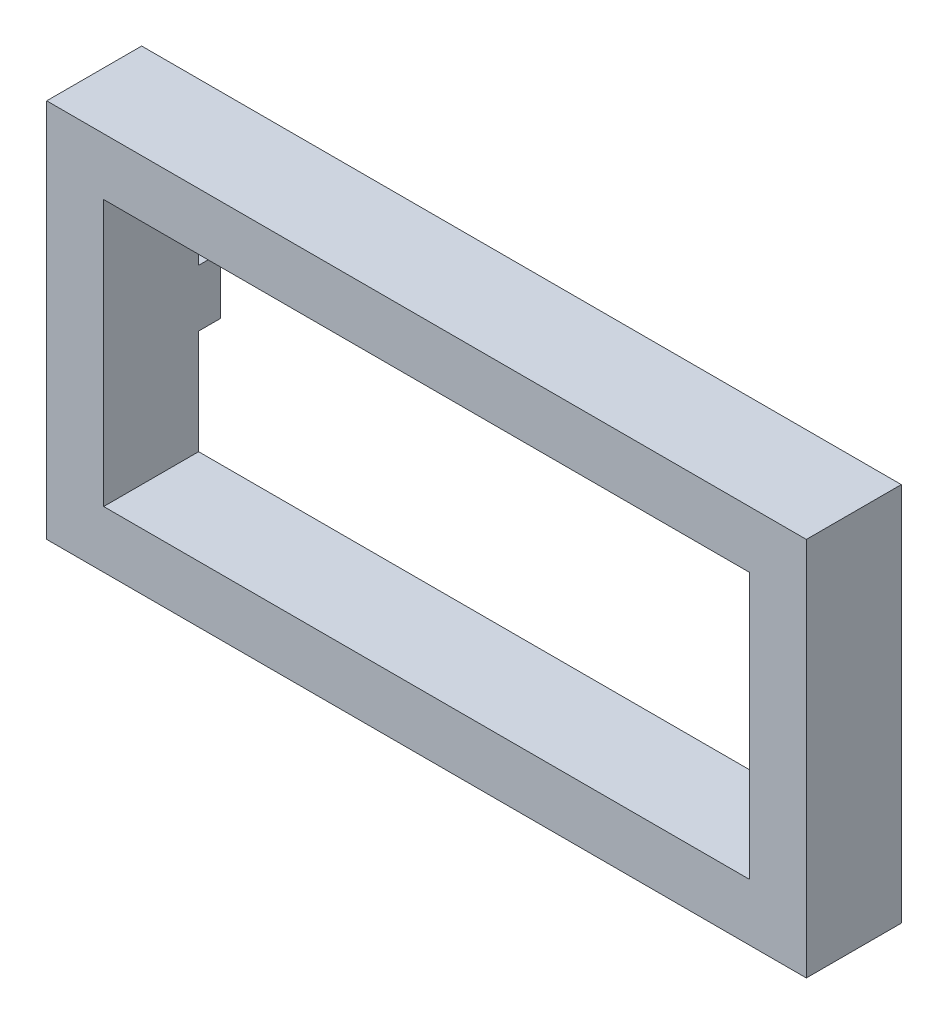
ISO-10303-21;
HEADER;
FILE_DESCRIPTION(('STEP AP214'),'2;1');
FILE_NAME('part.step','',(''),(''),'','','');
FILE_SCHEMA(('AUTOMOTIVE_DESIGN { 1 0 10303 214 1 1 1 1 }'));
ENDSEC;
DATA;
#1=APPLICATION_CONTEXT('core data for automotive mechanical design processes');
#2=APPLICATION_PROTOCOL_DEFINITION('international standard','automotive_design',2000,#1);
#3=PRODUCT_CONTEXT('',#1,'mechanical');
#4=PRODUCT('Part','Part','',(#3));
#5=PRODUCT_RELATED_PRODUCT_CATEGORY('part','',(#4));
#6=PRODUCT_DEFINITION_FORMATION('','',#4);
#7=PRODUCT_DEFINITION_CONTEXT('part definition',#1,'design');
#8=PRODUCT_DEFINITION('design','',#6,#7);
#9=PRODUCT_DEFINITION_SHAPE('','',#8);
#10=(LENGTH_UNIT() NAMED_UNIT(*) SI_UNIT(.MILLI.,.METRE.));
#11=(NAMED_UNIT(*) PLANE_ANGLE_UNIT() SI_UNIT($,.RADIAN.));
#12=(NAMED_UNIT(*) SI_UNIT($,.STERADIAN.) SOLID_ANGLE_UNIT());
#13=UNCERTAINTY_MEASURE_WITH_UNIT(LENGTH_MEASURE(1.E-05),#10,'distance_accuracy_value','');
#14=(GEOMETRIC_REPRESENTATION_CONTEXT(3) GLOBAL_UNCERTAINTY_ASSIGNED_CONTEXT((#13)) GLOBAL_UNIT_ASSIGNED_CONTEXT((#10,
#11,#12)) REPRESENTATION_CONTEXT('',''));
#15=CARTESIAN_POINT('',(0.,0.,0.));
#16=DIRECTION('',(0.,0.,1.));
#17=DIRECTION('',(1.,0.,0.));
#18=AXIS2_PLACEMENT_3D('',#15,#16,#17);
#19=CARTESIAN_POINT('',(0.,0.,0.));
#20=DIRECTION('',(0.,0.,1.));
#21=DIRECTION('',(1.,0.,0.));
#22=AXIS2_PLACEMENT_3D('',#19,#20,#21);
#23=PLANE('',#22);
#24=DIRECTION('',(1.,0.,0.));
#25=VECTOR('',#24,1.);
#26=CARTESIAN_POINT('',(70.4166666666664,92.4999999999996,0.));
#27=LINE('',#26,#25);
#28=CARTESIAN_POINT('',(70.4166666666664,92.4999999999996,0.));
#29=VERTEX_POINT('',#28);
#30=CARTESIAN_POINT('',(85.4166666666664,92.4999999999996,0.));
#31=VERTEX_POINT('',#30);
#32=EDGE_CURVE('E305',#29,#31,#27,.T.);
#33=ORIENTED_EDGE('',*,*,#32,.F.);
#34=DIRECTION('',(0.,1.,0.));
#35=VECTOR('',#34,1.);
#36=CARTESIAN_POINT('',(70.4166666666664,92.4999999999996,0.));
#37=LINE('',#36,#35);
#38=CARTESIAN_POINT('',(70.4166666666664,77.4999999999996,0.));
#39=VERTEX_POINT('',#38);
#40=EDGE_CURVE('E303',#39,#29,#37,.T.);
#41=ORIENTED_EDGE('',*,*,#40,.F.);
#42=DIRECTION('',(-1.,0.,0.));
#43=VECTOR('',#42,1.);
#44=CARTESIAN_POINT('',(70.4166666666664,77.4999999999996,0.));
#45=LINE('',#44,#43);
#46=CARTESIAN_POINT('',(85.4166666666664,77.4999999999996,0.));
#47=VERTEX_POINT('',#46);
#48=EDGE_CURVE('E293',#47,#39,#45,.T.);
#49=ORIENTED_EDGE('',*,*,#48,.F.);
#50=DIRECTION('',(0.,-1.,0.));
#51=VECTOR('',#50,1.);
#52=CARTESIAN_POINT('',(85.4166666666664,92.4999999999996,0.));
#53=LINE('',#52,#51);
#54=EDGE_CURVE('E309',#31,#47,#53,.T.);
#55=ORIENTED_EDGE('',*,*,#54,.F.);
#56=EDGE_LOOP('',(#33,#41,#49,#55));
#57=FACE_BOUND('',#56,.T.);
#58=DIRECTION('',(1.,0.,0.));
#59=VECTOR('',#58,1.);
#60=CARTESIAN_POINT('',(70.4166666666664,-77.5000000000004,0.));
#61=LINE('',#60,#59);
#62=CARTESIAN_POINT('',(70.4166666666664,-77.5000000000004,0.));
#63=VERTEX_POINT('',#62);
#64=CARTESIAN_POINT('',(85.4166666666664,-77.5000000000004,0.));
#65=VERTEX_POINT('',#64);
#66=EDGE_CURVE('E339',#63,#65,#61,.T.);
#67=ORIENTED_EDGE('',*,*,#66,.F.);
#68=DIRECTION('',(0.,1.,0.));
#69=VECTOR('',#68,1.);
#70=CARTESIAN_POINT('',(70.4166666666664,-77.5000000000004,0.));
#71=LINE('',#70,#69);
#72=CARTESIAN_POINT('',(70.4166666666664,-92.5000000000004,0.));
#73=VERTEX_POINT('',#72);
#74=EDGE_CURVE('E337',#73,#63,#71,.T.);
#75=ORIENTED_EDGE('',*,*,#74,.F.);
#76=DIRECTION('',(-1.,0.,0.));
#77=VECTOR('',#76,1.);
#78=CARTESIAN_POINT('',(70.4166666666664,-92.5000000000004,0.));
#79=LINE('',#78,#77);
#80=CARTESIAN_POINT('',(85.4166666666664,-92.5000000000004,0.));
#81=VERTEX_POINT('',#80);
#82=EDGE_CURVE('E327',#81,#73,#79,.T.);
#83=ORIENTED_EDGE('',*,*,#82,.F.);
#84=DIRECTION('',(0.,-1.,0.));
#85=VECTOR('',#84,1.);
#86=CARTESIAN_POINT('',(85.4166666666664,-77.5000000000004,0.));
#87=LINE('',#86,#85);
#88=EDGE_CURVE('E343',#65,#81,#87,.T.);
#89=ORIENTED_EDGE('',*,*,#88,.F.);
#90=EDGE_LOOP('',(#67,#75,#83,#89));
#91=FACE_BOUND('',#90,.T.);
#92=DIRECTION('',(0.999999825326349,-0.000591056065078465,0.));
#93=VECTOR('',#92,1.);
#94=CARTESIAN_POINT('',(182.916666666666,7.5022626264673,0.));
#95=LINE('',#94,#93);
#96=CARTESIAN_POINT('',(182.916666666666,7.5022626264673,0.));
#97=VERTEX_POINT('',#96);
#98=CARTESIAN_POINT('',(197.916664046562,7.49339678549112,0.));
#99=VERTEX_POINT('',#98);
#100=EDGE_CURVE('E370',#97,#99,#95,.T.);
#101=ORIENTED_EDGE('',*,*,#100,.F.);
#102=DIRECTION('',(0.,1.,0.));
#103=VECTOR('',#102,1.);
#104=CARTESIAN_POINT('',(182.916666666666,7.5022626264673,0.));
#105=LINE('',#104,#103);
#106=CARTESIAN_POINT('',(182.916666666666,-7.4977373735327,0.));
#107=VERTEX_POINT('',#106);
#108=EDGE_CURVE('E288',#107,#97,#105,.T.);
#109=ORIENTED_EDGE('',*,*,#108,.F.);
#110=DIRECTION('',(-0.999999825326349,0.000591056065078407,0.));
#111=VECTOR('',#110,1.);
#112=CARTESIAN_POINT('',(182.916666666666,-7.4977373735327,0.));
#113=LINE('',#112,#111);
#114=CARTESIAN_POINT('',(197.916664046562,-7.50660321450888,0.));
#115=VERTEX_POINT('',#114);
#116=EDGE_CURVE('E359',#115,#107,#113,.T.);
#117=ORIENTED_EDGE('',*,*,#116,.F.);
#118=DIRECTION('',(0.,-1.,0.));
#119=VECTOR('',#118,1.);
#120=CARTESIAN_POINT('',(197.916664046562,7.49339678549112,0.));
#121=LINE('',#120,#119);
#122=EDGE_CURVE('E373',#99,#115,#121,.T.);
#123=ORIENTED_EDGE('',*,*,#122,.F.);
#124=EDGE_LOOP('',(#101,#109,#117,#123));
#125=FACE_BOUND('',#124,.T.);
#126=DIRECTION('',(-1.,0.,0.));
#127=VECTOR('',#126,1.);
#128=CARTESIAN_POINT('',(-164.583333333334,-15.0000000000004,0.));
#129=LINE('',#128,#127);
#130=CARTESIAN_POINT('',(-164.583333333334,-15.0000000000004,0.));
#131=VERTEX_POINT('',#130);
#132=CARTESIAN_POINT('',(-194.583333333334,-15.0000000000004,0.));
#133=VERTEX_POINT('',#132);
#134=EDGE_CURVE('E61',#131,#133,#129,.T.);
#135=ORIENTED_EDGE('',*,*,#134,.F.);
#136=DIRECTION('',(0.,-1.,0.));
#137=VECTOR('',#136,1.);
#138=CARTESIAN_POINT('',(-164.583333333334,-70.0000000000004,0.));
#139=LINE('',#138,#137);
#140=CARTESIAN_POINT('',(-164.583333333334,-70.0000000000004,0.));
#141=VERTEX_POINT('',#140);
#142=EDGE_CURVE('E316',#131,#141,#139,.T.);
#143=ORIENTED_EDGE('',*,*,#142,.T.);
#144=DIRECTION('',(1.,0.,0.));
#145=VECTOR('',#144,1.);
#146=CARTESIAN_POINT('',(175.416666666666,-70.0000000000004,0.));
#147=LINE('',#146,#145);
#148=CARTESIAN_POINT('',(175.416666666666,-70.0000000000004,0.));
#149=VERTEX_POINT('',#148);
#150=EDGE_CURVE('E398',#141,#149,#147,.T.);
#151=ORIENTED_EDGE('',*,*,#150,.T.);
#152=DIRECTION('',(0.,1.,0.));
#153=VECTOR('',#152,1.);
#154=CARTESIAN_POINT('',(175.416666666666,-70.0000000000004,0.));
#155=LINE('',#154,#153);
#156=CARTESIAN_POINT('',(175.416666666666,69.9999999999996,0.));
#157=VERTEX_POINT('',#156);
#158=EDGE_CURVE('E401',#149,#157,#155,.T.);
#159=ORIENTED_EDGE('',*,*,#158,.T.);
#160=DIRECTION('',(-1.,0.,0.));
#161=VECTOR('',#160,1.);
#162=CARTESIAN_POINT('',(175.416666666666,69.9999999999996,0.));
#163=LINE('',#162,#161);
#164=CARTESIAN_POINT('',(-164.583333333334,69.9999999999996,0.));
#165=VERTEX_POINT('',#164);
#166=EDGE_CURVE('E388',#157,#165,#163,.T.);
#167=ORIENTED_EDGE('',*,*,#166,.T.);
#168=CARTESIAN_POINT('',(-164.583333333334,14.9999999999996,0.));
#169=VERTEX_POINT('',#168);
#170=EDGE_CURVE('E396',#165,#169,#139,.T.);
#171=ORIENTED_EDGE('',*,*,#170,.T.);
#172=DIRECTION('',(1.,0.,0.));
#173=VECTOR('',#172,1.);
#174=CARTESIAN_POINT('',(-164.583333333334,14.9999999999996,0.));
#175=LINE('',#174,#173);
#176=CARTESIAN_POINT('',(-194.583333333334,14.9999999999996,0.));
#177=VERTEX_POINT('',#176);
#178=EDGE_CURVE('E240',#177,#169,#175,.T.);
#179=ORIENTED_EDGE('',*,*,#178,.F.);
#180=DIRECTION('',(0.,-1.,0.));
#181=VECTOR('',#180,1.);
#182=CARTESIAN_POINT('',(-194.583333333334,-100.,0.));
#183=LINE('',#182,#181);
#184=CARTESIAN_POINT('',(-194.583333333334,99.9999999999996,0.));
#185=VERTEX_POINT('',#184);
#186=EDGE_CURVE('E427',#185,#177,#183,.T.);
#187=ORIENTED_EDGE('',*,*,#186,.F.);
#188=DIRECTION('',(-1.,0.,0.));
#189=VECTOR('',#188,1.);
#190=CARTESIAN_POINT('',(205.416666666666,99.9999999999996,0.));
#191=LINE('',#190,#189);
#192=CARTESIAN_POINT('',(205.416666666666,99.9999999999996,0.));
#193=VERTEX_POINT('',#192);
#194=EDGE_CURVE('E420',#193,#185,#191,.T.);
#195=ORIENTED_EDGE('',*,*,#194,.F.);
#196=DIRECTION('',(0.,1.,0.));
#197=VECTOR('',#196,1.);
#198=CARTESIAN_POINT('',(205.416666666666,-100.,0.));
#199=LINE('',#198,#197);
#200=CARTESIAN_POINT('',(205.416666666666,-100.,0.));
#201=VERTEX_POINT('',#200);
#202=EDGE_CURVE('E432',#201,#193,#199,.T.);
#203=ORIENTED_EDGE('',*,*,#202,.F.);
#204=DIRECTION('',(1.,0.,0.));
#205=VECTOR('',#204,1.);
#206=CARTESIAN_POINT('',(205.416666666666,-100.,0.));
#207=LINE('',#206,#205);
#208=CARTESIAN_POINT('',(-194.583333333334,-100.,0.));
#209=VERTEX_POINT('',#208);
#210=EDGE_CURVE('E430',#209,#201,#207,.T.);
#211=ORIENTED_EDGE('',*,*,#210,.F.);
#212=EDGE_CURVE('E415',#133,#209,#183,.T.);
#213=ORIENTED_EDGE('',*,*,#212,.F.);
#214=EDGE_LOOP('',(#135,#143,#151,#159,#167,#171,#179,#187,#195,#203,#211,#213));
#215=FACE_BOUND('',#214,.T.);
#216=ADVANCED_FACE('F38',(#57,#91,#125,#215),#23,.F.);
#217=CARTESIAN_POINT('',(0.,0.,50.));
#218=DIRECTION('',(0.,0.,1.));
#219=DIRECTION('',(1.,0.,0.));
#220=AXIS2_PLACEMENT_3D('',#217,#218,#219);
#221=PLANE('',#220);
#222=DIRECTION('',(0.,-1.,0.));
#223=VECTOR('',#222,1.);
#224=CARTESIAN_POINT('',(-194.583333333334,-100.,50.));
#225=LINE('',#224,#223);
#226=CARTESIAN_POINT('',(-194.583333333334,99.9999999999996,50.));
#227=VERTEX_POINT('',#226);
#228=CARTESIAN_POINT('',(-194.583333333334,-100.,50.));
#229=VERTEX_POINT('',#228);
#230=EDGE_CURVE('E416',#227,#229,#225,.T.);
#231=ORIENTED_EDGE('',*,*,#230,.T.);
#232=DIRECTION('',(1.,0.,0.));
#233=VECTOR('',#232,1.);
#234=CARTESIAN_POINT('',(205.416666666666,-100.,50.));
#235=LINE('',#234,#233);
#236=CARTESIAN_POINT('',(205.416666666666,-100.,50.));
#237=VERTEX_POINT('',#236);
#238=EDGE_CURVE('E419',#229,#237,#235,.T.);
#239=ORIENTED_EDGE('',*,*,#238,.T.);
#240=DIRECTION('',(0.,1.,0.));
#241=VECTOR('',#240,1.);
#242=CARTESIAN_POINT('',(205.416666666666,-100.,50.));
#243=LINE('',#242,#241);
#244=CARTESIAN_POINT('',(205.416666666666,99.9999999999996,50.));
#245=VERTEX_POINT('',#244);
#246=EDGE_CURVE('E422',#237,#245,#243,.T.);
#247=ORIENTED_EDGE('',*,*,#246,.T.);
#248=DIRECTION('',(-1.,0.,0.));
#249=VECTOR('',#248,1.);
#250=CARTESIAN_POINT('',(205.416666666666,99.9999999999996,50.));
#251=LINE('',#250,#249);
#252=EDGE_CURVE('E424',#245,#227,#251,.T.);
#253=ORIENTED_EDGE('',*,*,#252,.T.);
#254=EDGE_LOOP('',(#231,#239,#247,#253));
#255=FACE_BOUND('',#254,.T.);
#256=DIRECTION('',(1.,0.,0.));
#257=VECTOR('',#256,1.);
#258=CARTESIAN_POINT('',(175.416666666666,-70.0000000000004,50.));
#259=LINE('',#258,#257);
#260=CARTESIAN_POINT('',(-164.583333333334,-70.0000000000004,50.));
#261=VERTEX_POINT('',#260);
#262=CARTESIAN_POINT('',(175.416666666666,-70.0000000000004,50.));
#263=VERTEX_POINT('',#262);
#264=EDGE_CURVE('E387',#261,#263,#259,.T.);
#265=ORIENTED_EDGE('',*,*,#264,.F.);
#266=DIRECTION('',(0.,-1.,0.));
#267=VECTOR('',#266,1.);
#268=CARTESIAN_POINT('',(-164.583333333334,-70.0000000000004,50.));
#269=LINE('',#268,#267);
#270=CARTESIAN_POINT('',(-164.583333333334,69.9999999999996,50.));
#271=VERTEX_POINT('',#270);
#272=EDGE_CURVE('E385',#271,#261,#269,.T.);
#273=ORIENTED_EDGE('',*,*,#272,.F.);
#274=DIRECTION('',(-1.,0.,0.));
#275=VECTOR('',#274,1.);
#276=CARTESIAN_POINT('',(175.416666666666,69.9999999999996,50.));
#277=LINE('',#276,#275);
#278=CARTESIAN_POINT('',(175.416666666666,69.9999999999996,50.));
#279=VERTEX_POINT('',#278);
#280=EDGE_CURVE('E393',#279,#271,#277,.T.);
#281=ORIENTED_EDGE('',*,*,#280,.F.);
#282=DIRECTION('',(0.,1.,0.));
#283=VECTOR('',#282,1.);
#284=CARTESIAN_POINT('',(175.416666666666,-70.0000000000004,50.));
#285=LINE('',#284,#283);
#286=EDGE_CURVE('E390',#263,#279,#285,.T.);
#287=ORIENTED_EDGE('',*,*,#286,.F.);
#288=EDGE_LOOP('',(#265,#273,#281,#287));
#289=FACE_BOUND('',#288,.T.);
#290=ADVANCED_FACE('F459',(#255,#289),#221,.T.);
#291=CARTESIAN_POINT('',(-194.583333333334,-100.,50.));
#292=DIRECTION('',(1.,0.,0.));
#293=DIRECTION('',(0.,0.,-1.));
#294=AXIS2_PLACEMENT_3D('',#291,#292,#293);
#295=PLANE('',#294);
#296=ORIENTED_EDGE('',*,*,#186,.T.);
#297=DIRECTION('',(0.,0.,1.));
#298=VECTOR('',#297,1.);
#299=CARTESIAN_POINT('',(-194.583333333334,14.9999999999996,-11.5));
#300=LINE('',#299,#298);
#301=CARTESIAN_POINT('',(-194.583333333334,14.9999999999996,-11.5));
#302=VERTEX_POINT('',#301);
#303=EDGE_CURVE('E285',#302,#177,#300,.T.);
#304=ORIENTED_EDGE('',*,*,#303,.F.);
#305=DIRECTION('',(0.,1.,0.));
#306=VECTOR('',#305,1.);
#307=CARTESIAN_POINT('',(-194.583333333334,14.9999999999996,-11.5));
#308=LINE('',#307,#306);
#309=CARTESIAN_POINT('',(-194.583333333334,-15.0000000000004,-11.5));
#310=VERTEX_POINT('',#309);
#311=EDGE_CURVE('E264',#310,#302,#308,.T.);
#312=ORIENTED_EDGE('',*,*,#311,.F.);
#313=DIRECTION('',(0.,0.,1.));
#314=VECTOR('',#313,1.);
#315=CARTESIAN_POINT('',(-194.583333333334,-15.0000000000004,-11.5));
#316=LINE('',#315,#314);
#317=EDGE_CURVE('E273',#310,#133,#316,.T.);
#318=ORIENTED_EDGE('',*,*,#317,.T.);
#319=ORIENTED_EDGE('',*,*,#212,.T.);
#320=DIRECTION('',(0.,0.,-1.));
#321=VECTOR('',#320,1.);
#322=CARTESIAN_POINT('',(-194.583333333334,-100.,50.));
#323=LINE('',#322,#321);
#324=EDGE_CURVE('E11',#229,#209,#323,.T.);
#325=ORIENTED_EDGE('',*,*,#324,.F.);
#326=ORIENTED_EDGE('',*,*,#230,.F.);
#327=DIRECTION('',(0.,0.,-1.));
#328=VECTOR('',#327,1.);
#329=CARTESIAN_POINT('',(-194.583333333334,99.9999999999996,50.));
#330=LINE('',#329,#328);
#331=EDGE_CURVE('E426',#227,#185,#330,.T.);
#332=ORIENTED_EDGE('',*,*,#331,.T.);
#333=EDGE_LOOP('',(#296,#304,#312,#318,#319,#325,#326,#332));
#334=FACE_BOUND('',#333,.T.);
#335=ADVANCED_FACE('F40',(#334),#295,.F.);
#336=CARTESIAN_POINT('',(205.416666666666,-100.,50.));
#337=DIRECTION('',(0.,1.,0.));
#338=DIRECTION('',(-1.,0.,0.));
#339=AXIS2_PLACEMENT_3D('',#336,#337,#338);
#340=PLANE('',#339);
#341=ORIENTED_EDGE('',*,*,#210,.T.);
#342=DIRECTION('',(0.,0.,-1.));
#343=VECTOR('',#342,1.);
#344=CARTESIAN_POINT('',(205.416666666666,-100.,50.));
#345=LINE('',#344,#343);
#346=EDGE_CURVE('E46',#237,#201,#345,.T.);
#347=ORIENTED_EDGE('',*,*,#346,.F.);
#348=ORIENTED_EDGE('',*,*,#238,.F.);
#349=ORIENTED_EDGE('',*,*,#324,.T.);
#350=EDGE_LOOP('',(#341,#347,#348,#349));
#351=FACE_BOUND('',#350,.T.);
#352=ADVANCED_FACE('F461',(#351),#340,.F.);
#353=CARTESIAN_POINT('',(205.416666666666,-100.,50.));
#354=DIRECTION('',(-1.,0.,0.));
#355=DIRECTION('',(0.,-1.,0.));
#356=AXIS2_PLACEMENT_3D('',#353,#354,#355);
#357=PLANE('',#356);
#358=ORIENTED_EDGE('',*,*,#202,.T.);
#359=DIRECTION('',(0.,0.,-1.));
#360=VECTOR('',#359,1.);
#361=CARTESIAN_POINT('',(205.416666666666,99.9999999999996,50.));
#362=LINE('',#361,#360);
#363=EDGE_CURVE('E437',#245,#193,#362,.T.);
#364=ORIENTED_EDGE('',*,*,#363,.F.);
#365=ORIENTED_EDGE('',*,*,#246,.F.);
#366=ORIENTED_EDGE('',*,*,#346,.T.);
#367=EDGE_LOOP('',(#358,#364,#365,#366));
#368=FACE_BOUND('',#367,.T.);
#369=ADVANCED_FACE('F444',(#368),#357,.F.);
#370=CARTESIAN_POINT('',(205.416666666666,99.9999999999996,50.));
#371=DIRECTION('',(0.,-1.,0.));
#372=DIRECTION('',(1.,0.,0.));
#373=AXIS2_PLACEMENT_3D('',#370,#371,#372);
#374=PLANE('',#373);
#375=ORIENTED_EDGE('',*,*,#194,.T.);
#376=ORIENTED_EDGE('',*,*,#331,.F.);
#377=ORIENTED_EDGE('',*,*,#252,.F.);
#378=ORIENTED_EDGE('',*,*,#363,.T.);
#379=EDGE_LOOP('',(#375,#376,#377,#378));
#380=FACE_BOUND('',#379,.T.);
#381=ADVANCED_FACE('F452',(#380),#374,.F.);
#382=CARTESIAN_POINT('',(-164.583333333334,-70.0000000000004,50.));
#383=DIRECTION('',(1.,0.,0.));
#384=DIRECTION('',(0.,1.,0.));
#385=AXIS2_PLACEMENT_3D('',#382,#383,#384);
#386=PLANE('',#385);
#387=ORIENTED_EDGE('',*,*,#170,.F.);
#388=DIRECTION('',(0.,0.,-1.));
#389=VECTOR('',#388,1.);
#390=CARTESIAN_POINT('',(-164.583333333334,69.9999999999996,50.));
#391=LINE('',#390,#389);
#392=EDGE_CURVE('E395',#271,#165,#391,.T.);
#393=ORIENTED_EDGE('',*,*,#392,.F.);
#394=ORIENTED_EDGE('',*,*,#272,.T.);
#395=DIRECTION('',(0.,0.,-1.));
#396=VECTOR('',#395,1.);
#397=CARTESIAN_POINT('',(-164.583333333334,-70.0000000000004,50.));
#398=LINE('',#397,#396);
#399=EDGE_CURVE('E412',#261,#141,#398,.T.);
#400=ORIENTED_EDGE('',*,*,#399,.T.);
#401=ORIENTED_EDGE('',*,*,#142,.F.);
#402=DIRECTION('',(0.,0.,1.));
#403=VECTOR('',#402,1.);
#404=CARTESIAN_POINT('',(-164.583333333334,-15.0000000000004,-11.5));
#405=LINE('',#404,#403);
#406=CARTESIAN_POINT('',(-164.583333333334,-15.0000000000004,-11.5));
#407=VERTEX_POINT('',#406);
#408=EDGE_CURVE('E279',#407,#131,#405,.T.);
#409=ORIENTED_EDGE('',*,*,#408,.F.);
#410=DIRECTION('',(0.,-1.,0.));
#411=VECTOR('',#410,1.);
#412=CARTESIAN_POINT('',(-164.583333333334,14.9999999999996,-11.5));
#413=LINE('',#412,#411);
#414=CARTESIAN_POINT('',(-164.583333333334,14.9999999999996,-11.5));
#415=VERTEX_POINT('',#414);
#416=EDGE_CURVE('E269',#415,#407,#413,.T.);
#417=ORIENTED_EDGE('',*,*,#416,.F.);
#418=DIRECTION('',(0.,0.,1.));
#419=VECTOR('',#418,1.);
#420=CARTESIAN_POINT('',(-164.583333333334,14.9999999999996,-11.5));
#421=LINE('',#420,#419);
#422=EDGE_CURVE('E282',#415,#169,#421,.T.);
#423=ORIENTED_EDGE('',*,*,#422,.T.);
#424=EDGE_LOOP('',(#387,#393,#394,#400,#401,#409,#417,#423));
#425=FACE_BOUND('',#424,.T.);
#426=ADVANCED_FACE('F580',(#425),#386,.T.);
#427=CARTESIAN_POINT('',(175.416666666666,-70.0000000000004,50.));
#428=DIRECTION('',(0.,1.,0.));
#429=DIRECTION('',(-1.,0.,0.));
#430=AXIS2_PLACEMENT_3D('',#427,#428,#429);
#431=PLANE('',#430);
#432=ORIENTED_EDGE('',*,*,#150,.F.);
#433=ORIENTED_EDGE('',*,*,#399,.F.);
#434=ORIENTED_EDGE('',*,*,#264,.T.);
#435=DIRECTION('',(0.,0.,-1.));
#436=VECTOR('',#435,1.);
#437=CARTESIAN_POINT('',(175.416666666666,-70.0000000000004,50.));
#438=LINE('',#437,#436);
#439=EDGE_CURVE('E410',#263,#149,#438,.T.);
#440=ORIENTED_EDGE('',*,*,#439,.T.);
#441=EDGE_LOOP('',(#432,#433,#434,#440));
#442=FACE_BOUND('',#441,.T.);
#443=ADVANCED_FACE('F576',(#442),#431,.T.);
#444=CARTESIAN_POINT('',(175.416666666666,-70.0000000000004,50.));
#445=DIRECTION('',(-1.,0.,0.));
#446=DIRECTION('',(0.,-1.,0.));
#447=AXIS2_PLACEMENT_3D('',#444,#445,#446);
#448=PLANE('',#447);
#449=ORIENTED_EDGE('',*,*,#158,.F.);
#450=ORIENTED_EDGE('',*,*,#439,.F.);
#451=ORIENTED_EDGE('',*,*,#286,.T.);
#452=DIRECTION('',(0.,0.,-1.));
#453=VECTOR('',#452,1.);
#454=CARTESIAN_POINT('',(175.416666666666,69.9999999999996,50.));
#455=LINE('',#454,#453);
#456=EDGE_CURVE('E408',#279,#157,#455,.T.);
#457=ORIENTED_EDGE('',*,*,#456,.T.);
#458=EDGE_LOOP('',(#449,#450,#451,#457));
#459=FACE_BOUND('',#458,.T.);
#460=ADVANCED_FACE('F572',(#459),#448,.T.);
#461=CARTESIAN_POINT('',(175.416666666666,69.9999999999996,50.));
#462=DIRECTION('',(0.,-1.,0.));
#463=DIRECTION('',(1.,0.,0.));
#464=AXIS2_PLACEMENT_3D('',#461,#462,#463);
#465=PLANE('',#464);
#466=ORIENTED_EDGE('',*,*,#166,.F.);
#467=ORIENTED_EDGE('',*,*,#456,.F.);
#468=ORIENTED_EDGE('',*,*,#280,.T.);
#469=ORIENTED_EDGE('',*,*,#392,.T.);
#470=EDGE_LOOP('',(#466,#467,#468,#469));
#471=FACE_BOUND('',#470,.T.);
#472=ADVANCED_FACE('F568',(#471),#465,.T.);
#473=CARTESIAN_POINT('',(182.916666666666,7.5022626264673,40.));
#474=DIRECTION('',(-1.,0.,0.));
#475=DIRECTION('',(0.,0.,1.));
#476=AXIS2_PLACEMENT_3D('',#473,#474,#475);
#477=PLANE('',#476);
#478=ORIENTED_EDGE('',*,*,#108,.T.);
#479=DIRECTION('',(0.,0.,-1.));
#480=VECTOR('',#479,1.);
#481=CARTESIAN_POINT('',(182.916666666666,7.5022626264673,40.));
#482=LINE('',#481,#480);
#483=CARTESIAN_POINT('',(182.916666666666,7.5022626264673,40.));
#484=VERTEX_POINT('',#483);
#485=EDGE_CURVE('E368',#484,#97,#482,.T.);
#486=ORIENTED_EDGE('',*,*,#485,.F.);
#487=DIRECTION('',(0.,1.,0.));
#488=VECTOR('',#487,1.);
#489=CARTESIAN_POINT('',(182.916666666666,7.5022626264673,40.));
#490=LINE('',#489,#488);
#491=CARTESIAN_POINT('',(182.916666666666,-7.4977373735327,40.));
#492=VERTEX_POINT('',#491);
#493=EDGE_CURVE('E355',#492,#484,#490,.T.);
#494=ORIENTED_EDGE('',*,*,#493,.F.);
#495=DIRECTION('',(0.,0.,-1.));
#496=VECTOR('',#495,1.);
#497=CARTESIAN_POINT('',(182.916666666666,-7.4977373735327,40.));
#498=LINE('',#497,#496);
#499=EDGE_CURVE('E340',#492,#107,#498,.T.);
#500=ORIENTED_EDGE('',*,*,#499,.T.);
#501=EDGE_LOOP('',(#478,#486,#494,#500));
#502=FACE_BOUND('',#501,.T.);
#503=ADVANCED_FACE('F558',(#502),#477,.F.);
#504=CARTESIAN_POINT('',(182.916666666666,-7.4977373735327,40.));
#505=DIRECTION('',(-0.000591056065078407,-0.999999825326349,0.));
#506=DIRECTION('',(0.999999825326349,-0.000591056065078407,0.));
#507=AXIS2_PLACEMENT_3D('',#504,#505,#506);
#508=PLANE('',#507);
#509=ORIENTED_EDGE('',*,*,#116,.T.);
#510=ORIENTED_EDGE('',*,*,#499,.F.);
#511=DIRECTION('',(-0.999999825326349,0.000591056065078407,0.));
#512=VECTOR('',#511,1.);
#513=CARTESIAN_POINT('',(182.916666666666,-7.4977373735327,40.));
#514=LINE('',#513,#512);
#515=CARTESIAN_POINT('',(197.916664046562,-7.50660321450888,40.));
#516=VERTEX_POINT('',#515);
#517=EDGE_CURVE('E365',#516,#492,#514,.T.);
#518=ORIENTED_EDGE('',*,*,#517,.F.);
#519=DIRECTION('',(0.,0.,-1.));
#520=VECTOR('',#519,1.);
#521=CARTESIAN_POINT('',(197.916664046562,-7.50660321450888,40.));
#522=LINE('',#521,#520);
#523=EDGE_CURVE('E379',#516,#115,#522,.T.);
#524=ORIENTED_EDGE('',*,*,#523,.T.);
#525=EDGE_LOOP('',(#509,#510,#518,#524));
#526=FACE_BOUND('',#525,.T.);
#527=ADVANCED_FACE('F554',(#526),#508,.F.);
#528=CARTESIAN_POINT('',(197.916664046562,7.49339678549112,40.));
#529=DIRECTION('',(1.,0.,0.));
#530=DIRECTION('',(0.,0.,-1.));
#531=AXIS2_PLACEMENT_3D('',#528,#529,#530);
#532=PLANE('',#531);
#533=ORIENTED_EDGE('',*,*,#122,.T.);
#534=ORIENTED_EDGE('',*,*,#523,.F.);
#535=DIRECTION('',(0.,-1.,0.));
#536=VECTOR('',#535,1.);
#537=CARTESIAN_POINT('',(197.916664046562,7.49339678549112,40.));
#538=LINE('',#537,#536);
#539=CARTESIAN_POINT('',(197.916664046562,7.49339678549112,40.));
#540=VERTEX_POINT('',#539);
#541=EDGE_CURVE('E362',#540,#516,#538,.T.);
#542=ORIENTED_EDGE('',*,*,#541,.F.);
#543=DIRECTION('',(0.,0.,-1.));
#544=VECTOR('',#543,1.);
#545=CARTESIAN_POINT('',(197.916664046562,7.49339678549112,40.));
#546=LINE('',#545,#544);
#547=EDGE_CURVE('E381',#540,#99,#546,.T.);
#548=ORIENTED_EDGE('',*,*,#547,.T.);
#549=EDGE_LOOP('',(#533,#534,#542,#548));
#550=FACE_BOUND('',#549,.T.);
#551=ADVANCED_FACE('F557',(#550),#532,.F.);
#552=CARTESIAN_POINT('',(182.916666666666,7.5022626264673,40.));
#553=DIRECTION('',(0.000591056065078465,0.999999825326349,0.));
#554=DIRECTION('',(-0.999999825326349,0.000591056065078465,0.));
#555=AXIS2_PLACEMENT_3D('',#552,#553,#554);
#556=PLANE('',#555);
#557=ORIENTED_EDGE('',*,*,#100,.T.);
#558=ORIENTED_EDGE('',*,*,#547,.F.);
#559=DIRECTION('',(0.999999825326349,-0.000591056065078465,0.));
#560=VECTOR('',#559,1.);
#561=CARTESIAN_POINT('',(182.916666666666,7.5022626264673,40.));
#562=LINE('',#561,#560);
#563=EDGE_CURVE('E358',#484,#540,#562,.T.);
#564=ORIENTED_EDGE('',*,*,#563,.F.);
#565=ORIENTED_EDGE('',*,*,#485,.T.);
#566=EDGE_LOOP('',(#557,#558,#564,#565));
#567=FACE_BOUND('',#566,.T.);
#568=ADVANCED_FACE('F552',(#567),#556,.F.);
#569=CARTESIAN_POINT('',(0.,0.,40.));
#570=DIRECTION('',(0.,0.,1.));
#571=DIRECTION('',(1.,0.,0.));
#572=AXIS2_PLACEMENT_3D('',#569,#570,#571);
#573=PLANE('',#572);
#574=ORIENTED_EDGE('',*,*,#493,.T.);
#575=ORIENTED_EDGE('',*,*,#563,.T.);
#576=ORIENTED_EDGE('',*,*,#541,.T.);
#577=ORIENTED_EDGE('',*,*,#517,.T.);
#578=EDGE_LOOP('',(#574,#575,#576,#577));
#579=FACE_BOUND('',#578,.T.);
#580=ADVANCED_FACE('F548',(#579),#573,.F.);
#581=CARTESIAN_POINT('',(70.4166666666664,-77.5000000000004,40.));
#582=DIRECTION('',(-1.,0.,0.));
#583=DIRECTION('',(0.,0.,1.));
#584=AXIS2_PLACEMENT_3D('',#581,#582,#583);
#585=PLANE('',#584);
#586=ORIENTED_EDGE('',*,*,#74,.T.);
#587=DIRECTION('',(0.,0.,-1.));
#588=VECTOR('',#587,1.);
#589=CARTESIAN_POINT('',(70.4166666666664,-77.5000000000004,40.));
#590=LINE('',#589,#588);
#591=CARTESIAN_POINT('',(70.4166666666664,-77.5000000000004,40.));
#592=VERTEX_POINT('',#591);
#593=EDGE_CURVE('E336',#592,#63,#590,.T.);
#594=ORIENTED_EDGE('',*,*,#593,.F.);
#595=DIRECTION('',(0.,1.,0.));
#596=VECTOR('',#595,1.);
#597=CARTESIAN_POINT('',(70.4166666666664,-77.5000000000004,40.));
#598=LINE('',#597,#596);
#599=CARTESIAN_POINT('',(70.4166666666664,-92.5000000000004,40.));
#600=VERTEX_POINT('',#599);
#601=EDGE_CURVE('E323',#600,#592,#598,.T.);
#602=ORIENTED_EDGE('',*,*,#601,.F.);
#603=DIRECTION('',(0.,0.,-1.));
#604=VECTOR('',#603,1.);
#605=CARTESIAN_POINT('',(70.4166666666664,-92.5000000000004,40.));
#606=LINE('',#605,#604);
#607=EDGE_CURVE('E306',#600,#73,#606,.T.);
#608=ORIENTED_EDGE('',*,*,#607,.T.);
#609=EDGE_LOOP('',(#586,#594,#602,#608));
#610=FACE_BOUND('',#609,.T.);
#611=ADVANCED_FACE('F538',(#610),#585,.F.);
#612=CARTESIAN_POINT('',(70.4166666666664,-92.5000000000004,40.));
#613=DIRECTION('',(0.,-1.,0.));
#614=DIRECTION('',(0.,0.,-1.));
#615=AXIS2_PLACEMENT_3D('',#612,#613,#614);
#616=PLANE('',#615);
#617=ORIENTED_EDGE('',*,*,#82,.T.);
#618=ORIENTED_EDGE('',*,*,#607,.F.);
#619=DIRECTION('',(-1.,0.,0.));
#620=VECTOR('',#619,1.);
#621=CARTESIAN_POINT('',(70.4166666666664,-92.5000000000004,40.));
#622=LINE('',#621,#620);
#623=CARTESIAN_POINT('',(85.4166666666664,-92.5000000000004,40.));
#624=VERTEX_POINT('',#623);
#625=EDGE_CURVE('E333',#624,#600,#622,.T.);
#626=ORIENTED_EDGE('',*,*,#625,.F.);
#627=DIRECTION('',(0.,0.,-1.));
#628=VECTOR('',#627,1.);
#629=CARTESIAN_POINT('',(85.4166666666664,-92.5000000000004,40.));
#630=LINE('',#629,#628);
#631=EDGE_CURVE('E349',#624,#81,#630,.T.);
#632=ORIENTED_EDGE('',*,*,#631,.T.);
#633=EDGE_LOOP('',(#617,#618,#626,#632));
#634=FACE_BOUND('',#633,.T.);
#635=ADVANCED_FACE('F534',(#634),#616,.F.);
#636=CARTESIAN_POINT('',(85.4166666666664,-77.5000000000004,40.));
#637=DIRECTION('',(1.,0.,0.));
#638=DIRECTION('',(0.,0.,-1.));
#639=AXIS2_PLACEMENT_3D('',#636,#637,#638);
#640=PLANE('',#639);
#641=ORIENTED_EDGE('',*,*,#88,.T.);
#642=ORIENTED_EDGE('',*,*,#631,.F.);
#643=DIRECTION('',(0.,-1.,0.));
#644=VECTOR('',#643,1.);
#645=CARTESIAN_POINT('',(85.4166666666664,-77.5000000000004,40.));
#646=LINE('',#645,#644);
#647=CARTESIAN_POINT('',(85.4166666666664,-77.5000000000004,40.));
#648=VERTEX_POINT('',#647);
#649=EDGE_CURVE('E330',#648,#624,#646,.T.);
#650=ORIENTED_EDGE('',*,*,#649,.F.);
#651=DIRECTION('',(0.,0.,-1.));
#652=VECTOR('',#651,1.);
#653=CARTESIAN_POINT('',(85.4166666666664,-77.5000000000004,40.));
#654=LINE('',#653,#652);
#655=EDGE_CURVE('E351',#648,#65,#654,.T.);
#656=ORIENTED_EDGE('',*,*,#655,.T.);
#657=EDGE_LOOP('',(#641,#642,#650,#656));
#658=FACE_BOUND('',#657,.T.);
#659=ADVANCED_FACE('F537',(#658),#640,.F.);
#660=CARTESIAN_POINT('',(70.4166666666664,-77.5000000000004,40.));
#661=DIRECTION('',(0.,1.,0.));
#662=DIRECTION('',(0.,0.,1.));
#663=AXIS2_PLACEMENT_3D('',#660,#661,#662);
#664=PLANE('',#663);
#665=ORIENTED_EDGE('',*,*,#66,.T.);
#666=ORIENTED_EDGE('',*,*,#655,.F.);
#667=DIRECTION('',(1.,0.,0.));
#668=VECTOR('',#667,1.);
#669=CARTESIAN_POINT('',(70.4166666666664,-77.5000000000004,40.));
#670=LINE('',#669,#668);
#671=EDGE_CURVE('E326',#592,#648,#670,.T.);
#672=ORIENTED_EDGE('',*,*,#671,.F.);
#673=ORIENTED_EDGE('',*,*,#593,.T.);
#674=EDGE_LOOP('',(#665,#666,#672,#673));
#675=FACE_BOUND('',#674,.T.);
#676=ADVANCED_FACE('F532',(#675),#664,.F.);
#677=CARTESIAN_POINT('',(0.,0.,40.));
#678=DIRECTION('',(0.,0.,1.));
#679=DIRECTION('',(1.,0.,0.));
#680=AXIS2_PLACEMENT_3D('',#677,#678,#679);
#681=PLANE('',#680);
#682=ORIENTED_EDGE('',*,*,#601,.T.);
#683=ORIENTED_EDGE('',*,*,#671,.T.);
#684=ORIENTED_EDGE('',*,*,#649,.T.);
#685=ORIENTED_EDGE('',*,*,#625,.T.);
#686=EDGE_LOOP('',(#682,#683,#684,#685));
#687=FACE_BOUND('',#686,.T.);
#688=ADVANCED_FACE('F528',(#687),#681,.F.);
#689=CARTESIAN_POINT('',(70.4166666666664,92.4999999999996,40.));
#690=DIRECTION('',(-1.,0.,0.));
#691=DIRECTION('',(0.,-1.,0.));
#692=AXIS2_PLACEMENT_3D('',#689,#690,#691);
#693=PLANE('',#692);
#694=ORIENTED_EDGE('',*,*,#40,.T.);
#695=DIRECTION('',(0.,0.,-1.));
#696=VECTOR('',#695,1.);
#697=CARTESIAN_POINT('',(70.4166666666664,92.4999999999996,40.));
#698=LINE('',#697,#696);
#699=CARTESIAN_POINT('',(70.4166666666664,92.4999999999996,40.));
#700=VERTEX_POINT('',#699);
#701=EDGE_CURVE('E302',#700,#29,#698,.T.);
#702=ORIENTED_EDGE('',*,*,#701,.F.);
#703=DIRECTION('',(0.,1.,0.));
#704=VECTOR('',#703,1.);
#705=CARTESIAN_POINT('',(70.4166666666664,92.4999999999996,40.));
#706=LINE('',#705,#704);
#707=CARTESIAN_POINT('',(70.4166666666664,77.4999999999996,40.));
#708=VERTEX_POINT('',#707);
#709=EDGE_CURVE('E289',#708,#700,#706,.T.);
#710=ORIENTED_EDGE('',*,*,#709,.F.);
#711=DIRECTION('',(0.,0.,-1.));
#712=VECTOR('',#711,1.);
#713=CARTESIAN_POINT('',(70.4166666666664,77.4999999999996,40.));
#714=LINE('',#713,#712);
#715=EDGE_CURVE('E314',#708,#39,#714,.T.);
#716=ORIENTED_EDGE('',*,*,#715,.T.);
#717=EDGE_LOOP('',(#694,#702,#710,#716));
#718=FACE_BOUND('',#717,.T.);
#719=ADVANCED_FACE('F518',(#718),#693,.F.);
#720=CARTESIAN_POINT('',(70.4166666666664,77.4999999999996,40.));
#721=DIRECTION('',(0.,-1.,0.));
#722=DIRECTION('',(0.,0.,-1.));
#723=AXIS2_PLACEMENT_3D('',#720,#721,#722);
#724=PLANE('',#723);
#725=ORIENTED_EDGE('',*,*,#48,.T.);
#726=ORIENTED_EDGE('',*,*,#715,.F.);
#727=DIRECTION('',(-1.,0.,0.));
#728=VECTOR('',#727,1.);
#729=CARTESIAN_POINT('',(70.4166666666664,77.4999999999996,40.));
#730=LINE('',#729,#728);
#731=CARTESIAN_POINT('',(85.4166666666664,77.4999999999996,40.));
#732=VERTEX_POINT('',#731);
#733=EDGE_CURVE('E299',#732,#708,#730,.T.);
#734=ORIENTED_EDGE('',*,*,#733,.F.);
#735=DIRECTION('',(0.,0.,-1.));
#736=VECTOR('',#735,1.);
#737=CARTESIAN_POINT('',(85.4166666666664,77.4999999999996,40.));
#738=LINE('',#737,#736);
#739=EDGE_CURVE('E317',#732,#47,#738,.T.);
#740=ORIENTED_EDGE('',*,*,#739,.T.);
#741=EDGE_LOOP('',(#725,#726,#734,#740));
#742=FACE_BOUND('',#741,.T.);
#743=ADVANCED_FACE('F514',(#742),#724,.F.);
#744=CARTESIAN_POINT('',(85.4166666666664,92.4999999999996,40.));
#745=DIRECTION('',(1.,0.,0.));
#746=DIRECTION('',(0.,1.,0.));
#747=AXIS2_PLACEMENT_3D('',#744,#745,#746);
#748=PLANE('',#747);
#749=ORIENTED_EDGE('',*,*,#54,.T.);
#750=ORIENTED_EDGE('',*,*,#739,.F.);
#751=DIRECTION('',(0.,-1.,0.));
#752=VECTOR('',#751,1.);
#753=CARTESIAN_POINT('',(85.4166666666664,92.4999999999996,40.));
#754=LINE('',#753,#752);
#755=CARTESIAN_POINT('',(85.4166666666664,92.4999999999996,40.));
#756=VERTEX_POINT('',#755);
#757=EDGE_CURVE('E296',#756,#732,#754,.T.);
#758=ORIENTED_EDGE('',*,*,#757,.F.);
#759=DIRECTION('',(0.,0.,-1.));
#760=VECTOR('',#759,1.);
#761=CARTESIAN_POINT('',(85.4166666666664,92.4999999999996,40.));
#762=LINE('',#761,#760);
#763=EDGE_CURVE('E319',#756,#31,#762,.T.);
#764=ORIENTED_EDGE('',*,*,#763,.T.);
#765=EDGE_LOOP('',(#749,#750,#758,#764));
#766=FACE_BOUND('',#765,.T.);
#767=ADVANCED_FACE('F517',(#766),#748,.F.);
#768=CARTESIAN_POINT('',(70.4166666666664,92.4999999999996,40.));
#769=DIRECTION('',(0.,1.,0.));
#770=DIRECTION('',(0.,0.,1.));
#771=AXIS2_PLACEMENT_3D('',#768,#769,#770);
#772=PLANE('',#771);
#773=ORIENTED_EDGE('',*,*,#32,.T.);
#774=ORIENTED_EDGE('',*,*,#763,.F.);
#775=DIRECTION('',(1.,0.,0.));
#776=VECTOR('',#775,1.);
#777=CARTESIAN_POINT('',(70.4166666666664,92.4999999999996,40.));
#778=LINE('',#777,#776);
#779=EDGE_CURVE('E292',#700,#756,#778,.T.);
#780=ORIENTED_EDGE('',*,*,#779,.F.);
#781=ORIENTED_EDGE('',*,*,#701,.T.);
#782=EDGE_LOOP('',(#773,#774,#780,#781));
#783=FACE_BOUND('',#782,.T.);
#784=ADVANCED_FACE('F512',(#783),#772,.F.);
#785=CARTESIAN_POINT('',(0.,0.,40.));
#786=DIRECTION('',(0.,0.,1.));
#787=DIRECTION('',(1.,0.,0.));
#788=AXIS2_PLACEMENT_3D('',#785,#786,#787);
#789=PLANE('',#788);
#790=ORIENTED_EDGE('',*,*,#709,.T.);
#791=ORIENTED_EDGE('',*,*,#779,.T.);
#792=ORIENTED_EDGE('',*,*,#757,.T.);
#793=ORIENTED_EDGE('',*,*,#733,.T.);
#794=EDGE_LOOP('',(#790,#791,#792,#793));
#795=FACE_BOUND('',#794,.T.);
#796=ADVANCED_FACE('F502',(#795),#789,.F.);
#797=CARTESIAN_POINT('',(0.,0.,-11.5));
#798=DIRECTION('',(0.,0.,-1.));
#799=DIRECTION('',(-1.,0.,0.));
#800=AXIS2_PLACEMENT_3D('',#797,#798,#799);
#801=PLANE('',#800);
#802=ORIENTED_EDGE('',*,*,#311,.T.);
#803=DIRECTION('',(1.,0.,0.));
#804=VECTOR('',#803,1.);
#805=CARTESIAN_POINT('',(-164.583333333334,14.9999999999996,-11.5));
#806=LINE('',#805,#804);
#807=EDGE_CURVE('E267',#302,#415,#806,.T.);
#808=ORIENTED_EDGE('',*,*,#807,.T.);
#809=ORIENTED_EDGE('',*,*,#416,.T.);
#810=DIRECTION('',(-1.,0.,0.));
#811=VECTOR('',#810,1.);
#812=CARTESIAN_POINT('',(-164.583333333334,-15.0000000000004,-11.5));
#813=LINE('',#812,#811);
#814=EDGE_CURVE('E271',#407,#310,#813,.T.);
#815=ORIENTED_EDGE('',*,*,#814,.T.);
#816=EDGE_LOOP('',(#802,#808,#809,#815));
#817=FACE_BOUND('',#816,.T.);
#818=DIRECTION('',(1.,0.,0.));
#819=VECTOR('',#818,1.);
#820=CARTESIAN_POINT('',(-169.583333333334,9.9999999999996,-11.5));
#821=LINE('',#820,#819);
#822=CARTESIAN_POINT('',(-189.583333333334,9.9999999999996,-11.5));
#823=VERTEX_POINT('',#822);
#824=CARTESIAN_POINT('',(-169.583333333334,9.9999999999996,-11.5));
#825=VERTEX_POINT('',#824);
#826=EDGE_CURVE('E232',#823,#825,#821,.T.);
#827=ORIENTED_EDGE('',*,*,#826,.F.);
#828=DIRECTION('',(0.,1.,0.));
#829=VECTOR('',#828,1.);
#830=CARTESIAN_POINT('',(-189.583333333334,9.9999999999996,-11.5));
#831=LINE('',#830,#829);
#832=CARTESIAN_POINT('',(-189.583333333334,-10.0000000000004,-11.5));
#833=VERTEX_POINT('',#832);
#834=EDGE_CURVE('E224',#833,#823,#831,.T.);
#835=ORIENTED_EDGE('',*,*,#834,.F.);
#836=DIRECTION('',(-1.,0.,0.));
#837=VECTOR('',#836,1.);
#838=CARTESIAN_POINT('',(-169.583333333334,-10.0000000000004,-11.5));
#839=LINE('',#838,#837);
#840=CARTESIAN_POINT('',(-169.583333333334,-10.0000000000004,-11.5));
#841=VERTEX_POINT('',#840);
#842=EDGE_CURVE('E248',#841,#833,#839,.T.);
#843=ORIENTED_EDGE('',*,*,#842,.F.);
#844=DIRECTION('',(0.,-1.,0.));
#845=VECTOR('',#844,1.);
#846=CARTESIAN_POINT('',(-169.583333333334,9.9999999999996,-11.5));
#847=LINE('',#846,#845);
#848=EDGE_CURVE('E246',#825,#841,#847,.T.);
#849=ORIENTED_EDGE('',*,*,#848,.F.);
#850=EDGE_LOOP('',(#827,#835,#843,#849));
#851=FACE_BOUND('',#850,.T.);
#852=ADVANCED_FACE('F244',(#817,#851),#801,.T.);
#853=CARTESIAN_POINT('',(-164.583333333334,14.9999999999996,-11.5));
#854=DIRECTION('',(0.,-1.,0.));
#855=DIRECTION('',(1.,0.,0.));
#856=AXIS2_PLACEMENT_3D('',#853,#854,#855);
#857=PLANE('',#856);
#858=ORIENTED_EDGE('',*,*,#178,.T.);
#859=ORIENTED_EDGE('',*,*,#422,.F.);
#860=ORIENTED_EDGE('',*,*,#807,.F.);
#861=ORIENTED_EDGE('',*,*,#303,.T.);
#862=EDGE_LOOP('',(#858,#859,#860,#861));
#863=FACE_BOUND('',#862,.T.);
#864=ADVANCED_FACE('F501',(#863),#857,.F.);
#865=CARTESIAN_POINT('',(-164.583333333334,-15.0000000000004,-11.5));
#866=DIRECTION('',(0.,1.,0.));
#867=DIRECTION('',(-1.,0.,0.));
#868=AXIS2_PLACEMENT_3D('',#865,#866,#867);
#869=PLANE('',#868);
#870=ORIENTED_EDGE('',*,*,#134,.T.);
#871=ORIENTED_EDGE('',*,*,#317,.F.);
#872=ORIENTED_EDGE('',*,*,#814,.F.);
#873=ORIENTED_EDGE('',*,*,#408,.T.);
#874=EDGE_LOOP('',(#870,#871,#872,#873));
#875=FACE_BOUND('',#874,.T.);
#876=ADVANCED_FACE('F498',(#875),#869,.F.);
#877=CARTESIAN_POINT('',(-189.583333333334,9.9999999999996,-11.5));
#878=DIRECTION('',(1.,0.,0.));
#879=DIRECTION('',(0.,0.,-1.));
#880=AXIS2_PLACEMENT_3D('',#877,#878,#879);
#881=PLANE('',#880);
#882=DIRECTION('',(0.,1.,0.));
#883=VECTOR('',#882,1.);
#884=CARTESIAN_POINT('',(-189.583333333334,9.9999999999996,0.));
#885=LINE('',#884,#883);
#886=CARTESIAN_POINT('',(-189.583333333334,-10.0000000000004,0.));
#887=VERTEX_POINT('',#886);
#888=CARTESIAN_POINT('',(-189.583333333334,9.9999999999996,0.));
#889=VERTEX_POINT('',#888);
#890=EDGE_CURVE('E252',#887,#889,#885,.T.);
#891=ORIENTED_EDGE('',*,*,#890,.F.);
#892=DIRECTION('',(0.,0.,1.));
#893=VECTOR('',#892,1.);
#894=CARTESIAN_POINT('',(-189.583333333334,-10.0000000000004,-11.5));
#895=LINE('',#894,#893);
#896=EDGE_CURVE('E53',#833,#887,#895,.T.);
#897=ORIENTED_EDGE('',*,*,#896,.F.);
#898=ORIENTED_EDGE('',*,*,#834,.T.);
#899=DIRECTION('',(0.,0.,1.));
#900=VECTOR('',#899,1.);
#901=CARTESIAN_POINT('',(-189.583333333334,9.9999999999996,-11.5));
#902=LINE('',#901,#900);
#903=EDGE_CURVE('E227',#823,#889,#902,.T.);
#904=ORIENTED_EDGE('',*,*,#903,.T.);
#905=EDGE_LOOP('',(#891,#897,#898,#904));
#906=FACE_BOUND('',#905,.T.);
#907=ADVANCED_FACE('F226',(#906),#881,.T.);
#908=CARTESIAN_POINT('',(-169.583333333334,9.9999999999996,-11.5));
#909=DIRECTION('',(0.,-1.,0.));
#910=DIRECTION('',(0.,0.,-1.));
#911=AXIS2_PLACEMENT_3D('',#908,#909,#910);
#912=PLANE('',#911);
#913=DIRECTION('',(1.,0.,0.));
#914=VECTOR('',#913,1.);
#915=CARTESIAN_POINT('',(-169.583333333334,9.9999999999996,0.));
#916=LINE('',#915,#914);
#917=CARTESIAN_POINT('',(-169.583333333334,9.9999999999996,0.));
#918=VERTEX_POINT('',#917);
#919=EDGE_CURVE('E239',#889,#918,#916,.T.);
#920=ORIENTED_EDGE('',*,*,#919,.F.);
#921=ORIENTED_EDGE('',*,*,#903,.F.);
#922=ORIENTED_EDGE('',*,*,#826,.T.);
#923=DIRECTION('',(0.,0.,1.));
#924=VECTOR('',#923,1.);
#925=CARTESIAN_POINT('',(-169.583333333334,9.9999999999996,-11.5));
#926=LINE('',#925,#924);
#927=EDGE_CURVE('E241',#825,#918,#926,.T.);
#928=ORIENTED_EDGE('',*,*,#927,.T.);
#929=EDGE_LOOP('',(#920,#921,#922,#928));
#930=FACE_BOUND('',#929,.T.);
#931=ADVANCED_FACE('F236',(#930),#912,.T.);
#932=CARTESIAN_POINT('',(-169.583333333334,9.9999999999996,-11.5));
#933=DIRECTION('',(-1.,0.,0.));
#934=DIRECTION('',(0.,0.,1.));
#935=AXIS2_PLACEMENT_3D('',#932,#933,#934);
#936=PLANE('',#935);
#937=DIRECTION('',(0.,-1.,0.));
#938=VECTOR('',#937,1.);
#939=CARTESIAN_POINT('',(-169.583333333334,9.9999999999996,0.));
#940=LINE('',#939,#938);
#941=CARTESIAN_POINT('',(-169.583333333334,-10.0000000000004,0.));
#942=VERTEX_POINT('',#941);
#943=EDGE_CURVE('E255',#918,#942,#940,.T.);
#944=ORIENTED_EDGE('',*,*,#943,.F.);
#945=ORIENTED_EDGE('',*,*,#927,.F.);
#946=ORIENTED_EDGE('',*,*,#848,.T.);
#947=DIRECTION('',(0.,0.,1.));
#948=VECTOR('',#947,1.);
#949=CARTESIAN_POINT('',(-169.583333333334,-10.0000000000004,-11.5));
#950=LINE('',#949,#948);
#951=EDGE_CURVE('E261',#841,#942,#950,.T.);
#952=ORIENTED_EDGE('',*,*,#951,.T.);
#953=EDGE_LOOP('',(#944,#945,#946,#952));
#954=FACE_BOUND('',#953,.T.);
#955=ADVANCED_FACE('F485',(#954),#936,.T.);
#956=CARTESIAN_POINT('',(-169.583333333334,-10.0000000000004,-11.5));
#957=DIRECTION('',(0.,1.,0.));
#958=DIRECTION('',(-1.,0.,0.));
#959=AXIS2_PLACEMENT_3D('',#956,#957,#958);
#960=PLANE('',#959);
#961=DIRECTION('',(-1.,0.,0.));
#962=VECTOR('',#961,1.);
#963=CARTESIAN_POINT('',(-169.583333333334,-10.0000000000004,0.));
#964=LINE('',#963,#962);
#965=EDGE_CURVE('E233',#942,#887,#964,.T.);
#966=ORIENTED_EDGE('',*,*,#965,.F.);
#967=ORIENTED_EDGE('',*,*,#951,.F.);
#968=ORIENTED_EDGE('',*,*,#842,.T.);
#969=ORIENTED_EDGE('',*,*,#896,.T.);
#970=EDGE_LOOP('',(#966,#967,#968,#969));
#971=FACE_BOUND('',#970,.T.);
#972=ADVANCED_FACE('F480',(#971),#960,.T.);
#973=ORIENTED_EDGE('',*,*,#965,.T.);
#974=ORIENTED_EDGE('',*,*,#890,.T.);
#975=ORIENTED_EDGE('',*,*,#919,.T.);
#976=ORIENTED_EDGE('',*,*,#943,.T.);
#977=EDGE_LOOP('',(#973,#974,#975,#976));
#978=FACE_BOUND('',#977,.T.);
#979=ADVANCED_FACE('F471',(#978),#23,.F.);
#980=CLOSED_SHELL('',(#216,#290,#335,#352,#369,#381,#426,#443,#460,#472,#503,#527,#551,#568,
#580,#611,#635,#659,#676,#688,#719,#743,#767,#784,#796,#852,#864,#876,#907,#931,#955,#972,#979));
#981=MANIFOLD_SOLID_BREP('B2',#980);
#982=ADVANCED_BREP_SHAPE_REPRESENTATION('',(#18,#981),#14);
#983=SHAPE_DEFINITION_REPRESENTATION(#9,#982);
ENDSEC;
END-ISO-10303-21;
